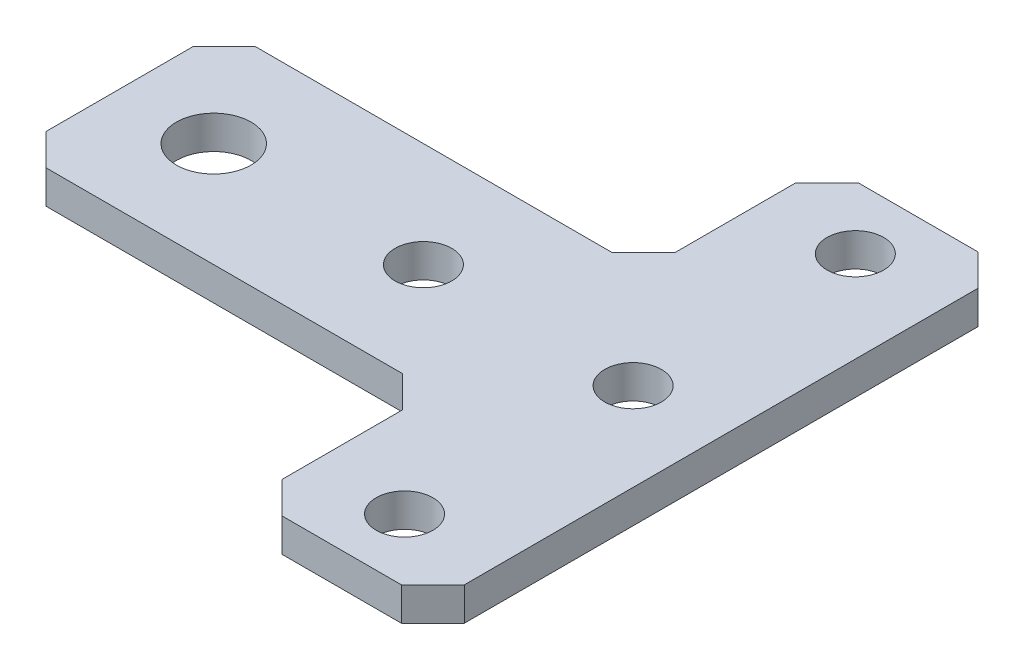
ISO-10303-21;
HEADER;
FILE_DESCRIPTION(('STEP AP214'),'2;1');
FILE_NAME('part.step','',(''),(''),'','','');
FILE_SCHEMA(('AUTOMOTIVE_DESIGN { 1 0 10303 214 1 1 1 1 }'));
ENDSEC;
DATA;
#1=APPLICATION_CONTEXT('core data for automotive mechanical design processes');
#2=APPLICATION_PROTOCOL_DEFINITION('international standard','automotive_design',2000,#1);
#3=PRODUCT_CONTEXT('',#1,'mechanical');
#4=PRODUCT('Part','Part','',(#3));
#5=PRODUCT_RELATED_PRODUCT_CATEGORY('part','',(#4));
#6=PRODUCT_DEFINITION_FORMATION('','',#4);
#7=PRODUCT_DEFINITION_CONTEXT('part definition',#1,'design');
#8=PRODUCT_DEFINITION('design','',#6,#7);
#9=PRODUCT_DEFINITION_SHAPE('','',#8);
#10=(LENGTH_UNIT() NAMED_UNIT(*) SI_UNIT(.MILLI.,.METRE.));
#11=(NAMED_UNIT(*) PLANE_ANGLE_UNIT() SI_UNIT($,.RADIAN.));
#12=(NAMED_UNIT(*) SI_UNIT($,.STERADIAN.) SOLID_ANGLE_UNIT());
#13=UNCERTAINTY_MEASURE_WITH_UNIT(LENGTH_MEASURE(1.E-05),#10,'distance_accuracy_value','');
#14=(GEOMETRIC_REPRESENTATION_CONTEXT(3) GLOBAL_UNCERTAINTY_ASSIGNED_CONTEXT((#13)) GLOBAL_UNIT_ASSIGNED_CONTEXT((#10,
#11,#12)) REPRESENTATION_CONTEXT('',''));
#15=CARTESIAN_POINT('',(0.,0.,0.));
#16=DIRECTION('',(0.,0.,1.));
#17=DIRECTION('',(1.,0.,0.));
#18=AXIS2_PLACEMENT_3D('',#15,#16,#17);
#19=CARTESIAN_POINT('',(0.,3.175,0.));
#20=DIRECTION('',(0.,-1.,0.));
#21=DIRECTION('',(0.,0.,-1.));
#22=AXIS2_PLACEMENT_3D('',#19,#20,#21);
#23=PLANE('',#22);
#24=DIRECTION('',(0.,0.,1.));
#25=VECTOR('',#24,1.);
#26=CARTESIAN_POINT('',(40.,3.175,-20.));
#27=LINE('',#26,#25);
#28=CARTESIAN_POINT('',(40.,3.175,-34.5));
#29=VERTEX_POINT('',#28);
#30=CARTESIAN_POINT('',(40.,3.175,-23.));
#31=VERTEX_POINT('',#30);
#32=EDGE_CURVE('E265',#29,#31,#27,.T.);
#33=ORIENTED_EDGE('',*,*,#32,.T.);
#34=DIRECTION('',(0.707106781186551,0.,-0.707106781186544));
#35=VECTOR('',#34,1.);
#36=CARTESIAN_POINT('',(8.49999999999982,3.175,8.4999999999999));
#37=LINE('',#36,#35);
#38=CARTESIAN_POINT('',(37.,3.175,-20.));
#39=VERTEX_POINT('',#38);
#40=EDGE_CURVE('E258',#31,#39,#37,.F.);
#41=ORIENTED_EDGE('',*,*,#40,.T.);
#42=DIRECTION('',(-1.,0.,0.));
#43=VECTOR('',#42,1.);
#44=CARTESIAN_POINT('',(0.,3.175,-20.));
#45=LINE('',#44,#43);
#46=CARTESIAN_POINT('',(3.00000000000002,3.175,-20.));
#47=VERTEX_POINT('',#46);
#48=EDGE_CURVE('E182',#39,#47,#45,.T.);
#49=ORIENTED_EDGE('',*,*,#48,.T.);
#50=DIRECTION('',(0.707106781186549,0.,-0.707106781186546));
#51=VECTOR('',#50,1.);
#52=CARTESIAN_POINT('',(0.,3.175,-17.));
#53=LINE('',#52,#51);
#54=CARTESIAN_POINT('',(0.,3.175,-17.));
#55=VERTEX_POINT('',#54);
#56=EDGE_CURVE('E221',#47,#55,#53,.F.);
#57=ORIENTED_EDGE('',*,*,#56,.T.);
#58=DIRECTION('',(0.,0.,1.));
#59=VECTOR('',#58,1.);
#60=CARTESIAN_POINT('',(0.,3.175,0.));
#61=LINE('',#60,#59);
#62=CARTESIAN_POINT('',(0.,3.175,-3.00000000000002));
#63=VERTEX_POINT('',#62);
#64=EDGE_CURVE('E167',#55,#63,#61,.T.);
#65=ORIENTED_EDGE('',*,*,#64,.T.);
#66=DIRECTION('',(-0.707106781186546,0.,-0.707106781186549));
#67=VECTOR('',#66,1.);
#68=CARTESIAN_POINT('',(3.00000000000001,3.175,0.));
#69=LINE('',#68,#67);
#70=CARTESIAN_POINT('',(3.00000000000001,3.175,0.));
#71=VERTEX_POINT('',#70);
#72=EDGE_CURVE('E219',#63,#71,#69,.F.);
#73=ORIENTED_EDGE('',*,*,#72,.T.);
#74=DIRECTION('',(1.,0.,0.));
#75=VECTOR('',#74,1.);
#76=CARTESIAN_POINT('',(0.,3.175,0.));
#77=LINE('',#76,#75);
#78=CARTESIAN_POINT('',(37.,3.175,0.));
#79=VERTEX_POINT('',#78);
#80=EDGE_CURVE('E320',#71,#79,#77,.T.);
#81=ORIENTED_EDGE('',*,*,#80,.T.);
#82=DIRECTION('',(-0.707106781186543,0.,-0.707106781186552));
#83=VECTOR('',#82,1.);
#84=CARTESIAN_POINT('',(18.5000000000002,3.175,-18.5));
#85=LINE('',#84,#83);
#86=CARTESIAN_POINT('',(40.,3.175,3.00000000000002));
#87=VERTEX_POINT('',#86);
#88=EDGE_CURVE('E11',#79,#87,#85,.F.);
#89=ORIENTED_EDGE('',*,*,#88,.T.);
#90=DIRECTION('',(0.,0.,1.));
#91=VECTOR('',#90,1.);
#92=CARTESIAN_POINT('',(40.,3.175,17.5));
#93=LINE('',#92,#91);
#94=CARTESIAN_POINT('',(40.,3.175,14.5));
#95=VERTEX_POINT('',#94);
#96=EDGE_CURVE('E317',#87,#95,#93,.T.);
#97=ORIENTED_EDGE('',*,*,#96,.T.);
#98=DIRECTION('',(-0.707106781186544,0.,-0.707106781186551));
#99=VECTOR('',#98,1.);
#100=CARTESIAN_POINT('',(43.,3.175,17.5));
#101=LINE('',#100,#99);
#102=CARTESIAN_POINT('',(43.,3.175,17.5));
#103=VERTEX_POINT('',#102);
#104=EDGE_CURVE('E215',#95,#103,#101,.F.);
#105=ORIENTED_EDGE('',*,*,#104,.T.);
#106=DIRECTION('',(1.,0.,0.));
#107=VECTOR('',#106,1.);
#108=CARTESIAN_POINT('',(40.,3.175,17.5));
#109=LINE('',#108,#107);
#110=CARTESIAN_POINT('',(54.4,3.175,17.5));
#111=VERTEX_POINT('',#110);
#112=EDGE_CURVE('E308',#103,#111,#109,.T.);
#113=ORIENTED_EDGE('',*,*,#112,.T.);
#114=DIRECTION('',(-0.707106781186548,0.,0.707106781186547));
#115=VECTOR('',#114,1.);
#116=CARTESIAN_POINT('',(57.4,3.175,14.5));
#117=LINE('',#116,#115);
#118=CARTESIAN_POINT('',(57.4,3.175,14.5));
#119=VERTEX_POINT('',#118);
#120=EDGE_CURVE('E217',#111,#119,#117,.F.);
#121=ORIENTED_EDGE('',*,*,#120,.T.);
#122=DIRECTION('',(0.,0.,-1.));
#123=VECTOR('',#122,1.);
#124=CARTESIAN_POINT('',(57.4,3.175,17.5));
#125=LINE('',#124,#123);
#126=CARTESIAN_POINT('',(57.4,3.175,-34.5));
#127=VERTEX_POINT('',#126);
#128=EDGE_CURVE('E297',#119,#127,#125,.T.);
#129=ORIENTED_EDGE('',*,*,#128,.T.);
#130=DIRECTION('',(0.707106781186548,0.,0.707106781186548));
#131=VECTOR('',#130,1.);
#132=CARTESIAN_POINT('',(54.4,3.175,-37.5));
#133=LINE('',#132,#131);
#134=CARTESIAN_POINT('',(54.4,3.175,-37.5));
#135=VERTEX_POINT('',#134);
#136=EDGE_CURVE('E213',#127,#135,#133,.F.);
#137=ORIENTED_EDGE('',*,*,#136,.T.);
#138=DIRECTION('',(-1.,0.,0.));
#139=VECTOR('',#138,1.);
#140=CARTESIAN_POINT('',(40.,3.175,-37.5));
#141=LINE('',#140,#139);
#142=CARTESIAN_POINT('',(43.,3.175,-37.5));
#143=VERTEX_POINT('',#142);
#144=EDGE_CURVE('E286',#135,#143,#141,.T.);
#145=ORIENTED_EDGE('',*,*,#144,.T.);
#146=DIRECTION('',(0.707106781186551,0.,-0.707106781186544));
#147=VECTOR('',#146,1.);
#148=CARTESIAN_POINT('',(40.,3.175,-34.5));
#149=LINE('',#148,#147);
#150=EDGE_CURVE('E211',#143,#29,#149,.F.);
#151=ORIENTED_EDGE('',*,*,#150,.T.);
#152=EDGE_LOOP('',(#33,#41,#49,#57,#65,#73,#81,#89,#97,#105,#113,#121,#129,#137,#145,#151));
#153=FACE_BOUND('',#152,.T.);
#154=CARTESIAN_POINT('',(29.,3.175,-10.));
#155=DIRECTION('',(0.,1.,0.));
#156=DIRECTION('',(0.,0.,1.));
#157=AXIS2_PLACEMENT_3D('',#154,#155,#156);
#158=CIRCLE('',#157,2.7);
#159=CARTESIAN_POINT('',(29.,3.175,-7.3));
#160=VERTEX_POINT('',#159);
#161=EDGE_CURVE('E174',#160,#160,#158,.T.);
#162=ORIENTED_EDGE('',*,*,#161,.F.);
#163=EDGE_LOOP('',(#162));
#164=FACE_BOUND('',#163,.T.);
#165=CARTESIAN_POINT('',(9.,3.175,-10.));
#166=DIRECTION('',(0.,1.,0.));
#167=DIRECTION('',(0.,0.,1.));
#168=AXIS2_PLACEMENT_3D('',#165,#166,#167);
#169=CIRCLE('',#168,3.56);
#170=CARTESIAN_POINT('',(9.,3.175,-6.44));
#171=VERTEX_POINT('',#170);
#172=EDGE_CURVE('E331',#171,#171,#169,.T.);
#173=ORIENTED_EDGE('',*,*,#172,.F.);
#174=EDGE_LOOP('',(#173));
#175=FACE_BOUND('',#174,.T.);
#176=CARTESIAN_POINT('',(48.7,3.175,-31.5));
#177=DIRECTION('',(0.,1.,0.));
#178=DIRECTION('',(0.,0.,1.));
#179=AXIS2_PLACEMENT_3D('',#176,#177,#178);
#180=CIRCLE('',#179,2.70000000000001);
#181=CARTESIAN_POINT('',(48.7,3.175,-28.8));
#182=VERTEX_POINT('',#181);
#183=EDGE_CURVE('E336',#182,#182,#180,.T.);
#184=ORIENTED_EDGE('',*,*,#183,.F.);
#185=EDGE_LOOP('',(#184));
#186=FACE_BOUND('',#185,.T.);
#187=CARTESIAN_POINT('',(48.7,3.175,11.5));
#188=DIRECTION('',(0.,1.,0.));
#189=DIRECTION('',(0.,0.,1.));
#190=AXIS2_PLACEMENT_3D('',#187,#188,#189);
#191=CIRCLE('',#190,2.70000000000001);
#192=CARTESIAN_POINT('',(48.7,3.175,14.2));
#193=VERTEX_POINT('',#192);
#194=EDGE_CURVE('E342',#193,#193,#191,.T.);
#195=ORIENTED_EDGE('',*,*,#194,.F.);
#196=EDGE_LOOP('',(#195));
#197=FACE_BOUND('',#196,.T.);
#198=CARTESIAN_POINT('',(49.,3.175,-10.));
#199=DIRECTION('',(0.,1.,0.));
#200=DIRECTION('',(0.,0.,1.));
#201=AXIS2_PLACEMENT_3D('',#198,#199,#200);
#202=CIRCLE('',#201,2.7);
#203=CARTESIAN_POINT('',(49.,3.175,-7.30000000000001));
#204=VERTEX_POINT('',#203);
#205=EDGE_CURVE('E348',#204,#204,#202,.T.);
#206=ORIENTED_EDGE('',*,*,#205,.F.);
#207=EDGE_LOOP('',(#206));
#208=FACE_BOUND('',#207,.T.);
#209=ADVANCED_FACE('F35',(#153,#164,#175,#186,#197,#208),#23,.F.);
#210=CARTESIAN_POINT('',(0.,0.,0.));
#211=DIRECTION('',(0.,-1.,0.));
#212=DIRECTION('',(0.,0.,-1.));
#213=AXIS2_PLACEMENT_3D('',#210,#211,#212);
#214=PLANE('',#213);
#215=CARTESIAN_POINT('',(48.7,0.,11.5));
#216=DIRECTION('',(0.,1.,0.));
#217=DIRECTION('',(0.,0.,1.));
#218=AXIS2_PLACEMENT_3D('',#215,#216,#217);
#219=CIRCLE('',#218,2.70000000000001);
#220=CARTESIAN_POINT('',(48.7,0.,14.2));
#221=VERTEX_POINT('',#220);
#222=EDGE_CURVE('E345',#221,#221,#219,.T.);
#223=ORIENTED_EDGE('',*,*,#222,.T.);
#224=EDGE_LOOP('',(#223));
#225=FACE_BOUND('',#224,.T.);
#226=CARTESIAN_POINT('',(9.,0.,-10.));
#227=DIRECTION('',(0.,1.,0.));
#228=DIRECTION('',(0.,0.,1.));
#229=AXIS2_PLACEMENT_3D('',#226,#227,#228);
#230=CIRCLE('',#229,3.56);
#231=CARTESIAN_POINT('',(9.,0.,-6.44));
#232=VERTEX_POINT('',#231);
#233=EDGE_CURVE('E333',#232,#232,#230,.T.);
#234=ORIENTED_EDGE('',*,*,#233,.T.);
#235=EDGE_LOOP('',(#234));
#236=FACE_BOUND('',#235,.T.);
#237=DIRECTION('',(0.,0.,1.));
#238=VECTOR('',#237,1.);
#239=CARTESIAN_POINT('',(0.,0.,0.));
#240=LINE('',#239,#238);
#241=CARTESIAN_POINT('',(0.,0.,-17.));
#242=VERTEX_POINT('',#241);
#243=CARTESIAN_POINT('',(0.,0.,-3.00000000000002));
#244=VERTEX_POINT('',#243);
#245=EDGE_CURVE('E164',#242,#244,#240,.T.);
#246=ORIENTED_EDGE('',*,*,#245,.F.);
#247=DIRECTION('',(-0.707106781186549,0.,0.707106781186546));
#248=VECTOR('',#247,1.);
#249=CARTESIAN_POINT('',(-8.49999999999999,0.,-8.50000000000004));
#250=LINE('',#249,#248);
#251=CARTESIAN_POINT('',(3.00000000000002,0.,-20.));
#252=VERTEX_POINT('',#251);
#253=EDGE_CURVE('E149',#242,#252,#250,.F.);
#254=ORIENTED_EDGE('',*,*,#253,.T.);
#255=DIRECTION('',(-1.,0.,0.));
#256=VECTOR('',#255,1.);
#257=CARTESIAN_POINT('',(0.,0.,-20.));
#258=LINE('',#257,#256);
#259=CARTESIAN_POINT('',(37.,0.,-20.));
#260=VERTEX_POINT('',#259);
#261=EDGE_CURVE('E198',#260,#252,#258,.T.);
#262=ORIENTED_EDGE('',*,*,#261,.F.);
#263=DIRECTION('',(-0.707106781186551,0.,0.707106781186544));
#264=VECTOR('',#263,1.);
#265=CARTESIAN_POINT('',(37.,0.,-20.));
#266=LINE('',#265,#264);
#267=CARTESIAN_POINT('',(40.,0.,-23.));
#268=VERTEX_POINT('',#267);
#269=EDGE_CURVE('E256',#260,#268,#266,.F.);
#270=ORIENTED_EDGE('',*,*,#269,.T.);
#271=DIRECTION('',(0.,0.,1.));
#272=VECTOR('',#271,1.);
#273=CARTESIAN_POINT('',(40.,0.,-20.));
#274=LINE('',#273,#272);
#275=CARTESIAN_POINT('',(40.,0.,-34.5));
#276=VERTEX_POINT('',#275);
#277=EDGE_CURVE('E195',#276,#268,#274,.T.);
#278=ORIENTED_EDGE('',*,*,#277,.F.);
#279=DIRECTION('',(-0.707106781186551,0.,0.707106781186544));
#280=VECTOR('',#279,1.);
#281=CARTESIAN_POINT('',(2.74999999999981,0.,2.74999999999983));
#282=LINE('',#281,#280);
#283=CARTESIAN_POINT('',(43.,0.,-37.5));
#284=VERTEX_POINT('',#283);
#285=EDGE_CURVE('E168',#276,#284,#282,.F.);
#286=ORIENTED_EDGE('',*,*,#285,.T.);
#287=DIRECTION('',(-1.,0.,0.));
#288=VECTOR('',#287,1.);
#289=CARTESIAN_POINT('',(40.,0.,-37.5));
#290=LINE('',#289,#288);
#291=CARTESIAN_POINT('',(54.4,0.,-37.5));
#292=VERTEX_POINT('',#291);
#293=EDGE_CURVE('E192',#292,#284,#290,.T.);
#294=ORIENTED_EDGE('',*,*,#293,.F.);
#295=DIRECTION('',(-0.707106781186548,0.,-0.707106781186548));
#296=VECTOR('',#295,1.);
#297=CARTESIAN_POINT('',(45.95,0.,-45.95));
#298=LINE('',#297,#296);
#299=CARTESIAN_POINT('',(57.4,0.,-34.5));
#300=VERTEX_POINT('',#299);
#301=EDGE_CURVE('E202',#292,#300,#298,.F.);
#302=ORIENTED_EDGE('',*,*,#301,.T.);
#303=DIRECTION('',(0.,0.,-1.));
#304=VECTOR('',#303,1.);
#305=CARTESIAN_POINT('',(57.4,0.,17.5));
#306=LINE('',#305,#304);
#307=CARTESIAN_POINT('',(57.4,0.,14.5));
#308=VERTEX_POINT('',#307);
#309=EDGE_CURVE('E189',#308,#300,#306,.T.);
#310=ORIENTED_EDGE('',*,*,#309,.F.);
#311=DIRECTION('',(0.707106781186548,0.,-0.707106781186547));
#312=VECTOR('',#311,1.);
#313=CARTESIAN_POINT('',(35.9499999999999,0.,35.95));
#314=LINE('',#313,#312);
#315=CARTESIAN_POINT('',(54.4,0.,17.5));
#316=VERTEX_POINT('',#315);
#317=EDGE_CURVE('E207',#308,#316,#314,.F.);
#318=ORIENTED_EDGE('',*,*,#317,.T.);
#319=DIRECTION('',(1.,0.,0.));
#320=VECTOR('',#319,1.);
#321=CARTESIAN_POINT('',(40.,0.,17.5));
#322=LINE('',#321,#320);
#323=CARTESIAN_POINT('',(43.,0.,17.5));
#324=VERTEX_POINT('',#323);
#325=EDGE_CURVE('E186',#324,#316,#322,.T.);
#326=ORIENTED_EDGE('',*,*,#325,.F.);
#327=DIRECTION('',(0.707106781186544,0.,0.707106781186551));
#328=VECTOR('',#327,1.);
#329=CARTESIAN_POINT('',(12.7500000000002,0.,-12.7500000000001));
#330=LINE('',#329,#328);
#331=CARTESIAN_POINT('',(40.,0.,14.5));
#332=VERTEX_POINT('',#331);
#333=EDGE_CURVE('E204',#324,#332,#330,.F.);
#334=ORIENTED_EDGE('',*,*,#333,.T.);
#335=DIRECTION('',(0.,0.,1.));
#336=VECTOR('',#335,1.);
#337=CARTESIAN_POINT('',(40.,0.,17.5));
#338=LINE('',#337,#336);
#339=CARTESIAN_POINT('',(40.,0.,3.00000000000002));
#340=VERTEX_POINT('',#339);
#341=EDGE_CURVE('E176',#340,#332,#338,.T.);
#342=ORIENTED_EDGE('',*,*,#341,.F.);
#343=DIRECTION('',(0.707106781186543,0.,0.707106781186552));
#344=VECTOR('',#343,1.);
#345=CARTESIAN_POINT('',(40.,0.,3.00000000000002));
#346=LINE('',#345,#344);
#347=CARTESIAN_POINT('',(37.,0.,0.));
#348=VERTEX_POINT('',#347);
#349=EDGE_CURVE('E43',#340,#348,#346,.F.);
#350=ORIENTED_EDGE('',*,*,#349,.T.);
#351=DIRECTION('',(1.,0.,0.));
#352=VECTOR('',#351,1.);
#353=CARTESIAN_POINT('',(0.,0.,0.));
#354=LINE('',#353,#352);
#355=CARTESIAN_POINT('',(3.00000000000001,0.,0.));
#356=VERTEX_POINT('',#355);
#357=EDGE_CURVE('E173',#356,#348,#354,.T.);
#358=ORIENTED_EDGE('',*,*,#357,.F.);
#359=DIRECTION('',(0.707106781186546,0.,0.707106781186549));
#360=VECTOR('',#359,1.);
#361=CARTESIAN_POINT('',(1.50000000000001,0.,-1.5));
#362=LINE('',#361,#360);
#363=EDGE_CURVE('E158',#356,#244,#362,.F.);
#364=ORIENTED_EDGE('',*,*,#363,.T.);
#365=EDGE_LOOP('',(#246,#254,#262,#270,#278,#286,#294,#302,#310,#318,#326,#334,#342,#350,#358,#364));
#366=FACE_BOUND('',#365,.T.);
#367=CARTESIAN_POINT('',(29.,0.,-10.));
#368=DIRECTION('',(0.,1.,0.));
#369=DIRECTION('',(0.,0.,1.));
#370=AXIS2_PLACEMENT_3D('',#367,#368,#369);
#371=CIRCLE('',#370,2.7);
#372=CARTESIAN_POINT('',(29.,0.,-7.3));
#373=VERTEX_POINT('',#372);
#374=EDGE_CURVE('E179',#373,#373,#371,.T.);
#375=ORIENTED_EDGE('',*,*,#374,.T.);
#376=EDGE_LOOP('',(#375));
#377=FACE_BOUND('',#376,.T.);
#378=CARTESIAN_POINT('',(48.7,0.,-31.5));
#379=DIRECTION('',(0.,1.,0.));
#380=DIRECTION('',(0.,0.,1.));
#381=AXIS2_PLACEMENT_3D('',#378,#379,#380);
#382=CIRCLE('',#381,2.70000000000001);
#383=CARTESIAN_POINT('',(48.7,0.,-28.8));
#384=VERTEX_POINT('',#383);
#385=EDGE_CURVE('E339',#384,#384,#382,.T.);
#386=ORIENTED_EDGE('',*,*,#385,.T.);
#387=EDGE_LOOP('',(#386));
#388=FACE_BOUND('',#387,.T.);
#389=CARTESIAN_POINT('',(49.,0.,-10.));
#390=DIRECTION('',(0.,1.,0.));
#391=DIRECTION('',(0.,0.,1.));
#392=AXIS2_PLACEMENT_3D('',#389,#390,#391);
#393=CIRCLE('',#392,2.7);
#394=CARTESIAN_POINT('',(49.,0.,-7.30000000000001));
#395=VERTEX_POINT('',#394);
#396=EDGE_CURVE('E351',#395,#395,#393,.T.);
#397=ORIENTED_EDGE('',*,*,#396,.T.);
#398=EDGE_LOOP('',(#397));
#399=FACE_BOUND('',#398,.T.);
#400=ADVANCED_FACE('F171',(#225,#236,#366,#377,#388,#399),#214,.T.);
#401=CARTESIAN_POINT('',(0.,3.175,0.));
#402=DIRECTION('',(1.,0.,0.));
#403=DIRECTION('',(0.,0.,-1.));
#404=AXIS2_PLACEMENT_3D('',#401,#402,#403);
#405=PLANE('',#404);
#406=ORIENTED_EDGE('',*,*,#64,.F.);
#407=DIRECTION('',(0.,-1.,0.));
#408=VECTOR('',#407,1.);
#409=CARTESIAN_POINT('',(0.,3.175,-17.));
#410=LINE('',#409,#408);
#411=EDGE_CURVE('E153',#55,#242,#410,.T.);
#412=ORIENTED_EDGE('',*,*,#411,.T.);
#413=ORIENTED_EDGE('',*,*,#245,.T.);
#414=DIRECTION('',(0.,1.,0.));
#415=VECTOR('',#414,1.);
#416=CARTESIAN_POINT('',(0.,3.175,-3.00000000000002));
#417=LINE('',#416,#415);
#418=EDGE_CURVE('E169',#244,#63,#417,.T.);
#419=ORIENTED_EDGE('',*,*,#418,.T.);
#420=EDGE_LOOP('',(#406,#412,#413,#419));
#421=FACE_BOUND('',#420,.T.);
#422=ADVANCED_FACE('F163',(#421),#405,.F.);
#423=CARTESIAN_POINT('',(0.,3.175,0.));
#424=DIRECTION('',(0.,0.,-1.));
#425=DIRECTION('',(-1.,0.,0.));
#426=AXIS2_PLACEMENT_3D('',#423,#424,#425);
#427=PLANE('',#426);
#428=ORIENTED_EDGE('',*,*,#357,.T.);
#429=DIRECTION('',(0.,1.,0.));
#430=VECTOR('',#429,1.);
#431=CARTESIAN_POINT('',(37.,3.175,0.));
#432=LINE('',#431,#430);
#433=EDGE_CURVE('E56',#348,#79,#432,.T.);
#434=ORIENTED_EDGE('',*,*,#433,.T.);
#435=ORIENTED_EDGE('',*,*,#80,.F.);
#436=DIRECTION('',(0.,-1.,0.));
#437=VECTOR('',#436,1.);
#438=CARTESIAN_POINT('',(3.00000000000001,3.175,0.));
#439=LINE('',#438,#437);
#440=EDGE_CURVE('E223',#71,#356,#439,.T.);
#441=ORIENTED_EDGE('',*,*,#440,.T.);
#442=EDGE_LOOP('',(#428,#434,#435,#441));
#443=FACE_BOUND('',#442,.T.);
#444=ADVANCED_FACE('F383',(#443),#427,.F.);
#445=CARTESIAN_POINT('',(40.,3.175,17.5));
#446=DIRECTION('',(1.,0.,0.));
#447=DIRECTION('',(0.,0.,-1.));
#448=AXIS2_PLACEMENT_3D('',#445,#446,#447);
#449=PLANE('',#448);
#450=ORIENTED_EDGE('',*,*,#96,.F.);
#451=DIRECTION('',(0.,-1.,0.));
#452=VECTOR('',#451,1.);
#453=CARTESIAN_POINT('',(40.,0.,3.00000000000002));
#454=LINE('',#453,#452);
#455=EDGE_CURVE('E252',#87,#340,#454,.T.);
#456=ORIENTED_EDGE('',*,*,#455,.T.);
#457=ORIENTED_EDGE('',*,*,#341,.T.);
#458=DIRECTION('',(0.,1.,0.));
#459=VECTOR('',#458,1.);
#460=CARTESIAN_POINT('',(40.,3.175,14.5));
#461=LINE('',#460,#459);
#462=EDGE_CURVE('E236',#332,#95,#461,.T.);
#463=ORIENTED_EDGE('',*,*,#462,.T.);
#464=EDGE_LOOP('',(#450,#456,#457,#463));
#465=FACE_BOUND('',#464,.T.);
#466=ADVANCED_FACE('F315',(#465),#449,.F.);
#467=CARTESIAN_POINT('',(40.,3.175,17.5));
#468=DIRECTION('',(0.,0.,-1.));
#469=DIRECTION('',(-1.,0.,0.));
#470=AXIS2_PLACEMENT_3D('',#467,#468,#469);
#471=PLANE('',#470);
#472=ORIENTED_EDGE('',*,*,#325,.T.);
#473=DIRECTION('',(0.,1.,0.));
#474=VECTOR('',#473,1.);
#475=CARTESIAN_POINT('',(54.4,3.175,17.5));
#476=LINE('',#475,#474);
#477=EDGE_CURVE('E234',#316,#111,#476,.T.);
#478=ORIENTED_EDGE('',*,*,#477,.T.);
#479=ORIENTED_EDGE('',*,*,#112,.F.);
#480=DIRECTION('',(0.,-1.,0.));
#481=VECTOR('',#480,1.);
#482=CARTESIAN_POINT('',(43.,3.175,17.5));
#483=LINE('',#482,#481);
#484=EDGE_CURVE('E231',#103,#324,#483,.T.);
#485=ORIENTED_EDGE('',*,*,#484,.T.);
#486=EDGE_LOOP('',(#472,#478,#479,#485));
#487=FACE_BOUND('',#486,.T.);
#488=ADVANCED_FACE('F304',(#487),#471,.F.);
#489=CARTESIAN_POINT('',(57.4,3.175,17.5));
#490=DIRECTION('',(-1.,0.,0.));
#491=DIRECTION('',(0.,0.,1.));
#492=AXIS2_PLACEMENT_3D('',#489,#490,#491);
#493=PLANE('',#492);
#494=ORIENTED_EDGE('',*,*,#128,.F.);
#495=DIRECTION('',(0.,-1.,0.));
#496=VECTOR('',#495,1.);
#497=CARTESIAN_POINT('',(57.4,3.175,14.5));
#498=LINE('',#497,#496);
#499=EDGE_CURVE('E228',#119,#308,#498,.T.);
#500=ORIENTED_EDGE('',*,*,#499,.T.);
#501=ORIENTED_EDGE('',*,*,#309,.T.);
#502=DIRECTION('',(0.,1.,0.));
#503=VECTOR('',#502,1.);
#504=CARTESIAN_POINT('',(57.4,3.175,-34.5));
#505=LINE('',#504,#503);
#506=EDGE_CURVE('E226',#300,#127,#505,.T.);
#507=ORIENTED_EDGE('',*,*,#506,.T.);
#508=EDGE_LOOP('',(#494,#500,#501,#507));
#509=FACE_BOUND('',#508,.T.);
#510=ADVANCED_FACE('F294',(#509),#493,.F.);
#511=CARTESIAN_POINT('',(40.,3.175,-37.5));
#512=DIRECTION('',(0.,0.,1.));
#513=DIRECTION('',(1.,0.,0.));
#514=AXIS2_PLACEMENT_3D('',#511,#512,#513);
#515=PLANE('',#514);
#516=ORIENTED_EDGE('',*,*,#144,.F.);
#517=DIRECTION('',(0.,-1.,0.));
#518=VECTOR('',#517,1.);
#519=CARTESIAN_POINT('',(54.4,3.175,-37.5));
#520=LINE('',#519,#518);
#521=EDGE_CURVE('E241',#135,#292,#520,.T.);
#522=ORIENTED_EDGE('',*,*,#521,.T.);
#523=ORIENTED_EDGE('',*,*,#293,.T.);
#524=DIRECTION('',(0.,1.,0.));
#525=VECTOR('',#524,1.);
#526=CARTESIAN_POINT('',(43.,3.175,-37.5));
#527=LINE('',#526,#525);
#528=EDGE_CURVE('E239',#284,#143,#527,.T.);
#529=ORIENTED_EDGE('',*,*,#528,.T.);
#530=EDGE_LOOP('',(#516,#522,#523,#529));
#531=FACE_BOUND('',#530,.T.);
#532=ADVANCED_FACE('F283',(#531),#515,.F.);
#533=CARTESIAN_POINT('',(40.,3.175,-20.));
#534=DIRECTION('',(1.,0.,0.));
#535=DIRECTION('',(0.,0.,-1.));
#536=AXIS2_PLACEMENT_3D('',#533,#534,#535);
#537=PLANE('',#536);
#538=ORIENTED_EDGE('',*,*,#277,.T.);
#539=DIRECTION('',(0.,1.,0.));
#540=VECTOR('',#539,1.);
#541=CARTESIAN_POINT('',(40.,3.175,-23.));
#542=LINE('',#541,#540);
#543=EDGE_CURVE('E250',#268,#31,#542,.T.);
#544=ORIENTED_EDGE('',*,*,#543,.T.);
#545=ORIENTED_EDGE('',*,*,#32,.F.);
#546=DIRECTION('',(0.,-1.,0.));
#547=VECTOR('',#546,1.);
#548=CARTESIAN_POINT('',(40.,3.175,-34.5));
#549=LINE('',#548,#547);
#550=EDGE_CURVE('E244',#29,#276,#549,.T.);
#551=ORIENTED_EDGE('',*,*,#550,.T.);
#552=EDGE_LOOP('',(#538,#544,#545,#551));
#553=FACE_BOUND('',#552,.T.);
#554=ADVANCED_FACE('F274',(#553),#537,.F.);
#555=CARTESIAN_POINT('',(0.,3.175,-20.));
#556=DIRECTION('',(0.,0.,1.));
#557=DIRECTION('',(1.,0.,0.));
#558=AXIS2_PLACEMENT_3D('',#555,#556,#557);
#559=PLANE('',#558);
#560=ORIENTED_EDGE('',*,*,#48,.F.);
#561=DIRECTION('',(0.,-1.,0.));
#562=VECTOR('',#561,1.);
#563=CARTESIAN_POINT('',(37.,0.,-20.));
#564=LINE('',#563,#562);
#565=EDGE_CURVE('E247',#39,#260,#564,.T.);
#566=ORIENTED_EDGE('',*,*,#565,.T.);
#567=ORIENTED_EDGE('',*,*,#261,.T.);
#568=DIRECTION('',(0.,1.,0.));
#569=VECTOR('',#568,1.);
#570=CARTESIAN_POINT('',(3.00000000000002,3.175,-20.));
#571=LINE('',#570,#569);
#572=EDGE_CURVE('E155',#252,#47,#571,.T.);
#573=ORIENTED_EDGE('',*,*,#572,.T.);
#574=EDGE_LOOP('',(#560,#566,#567,#573));
#575=FACE_BOUND('',#574,.T.);
#576=ADVANCED_FACE('F270',(#575),#559,.F.);
#577=CARTESIAN_POINT('',(29.,3.175,-10.));
#578=DIRECTION('',(0.,-1.,0.));
#579=DIRECTION('',(0.,0.,-1.));
#580=AXIS2_PLACEMENT_3D('',#577,#578,#579);
#581=CYLINDRICAL_SURFACE('',#580,2.7);
#582=ORIENTED_EDGE('',*,*,#161,.T.);
#583=EDGE_LOOP('',(#582));
#584=FACE_BOUND('',#583,.T.);
#585=ORIENTED_EDGE('',*,*,#374,.F.);
#586=EDGE_LOOP('',(#585));
#587=FACE_BOUND('',#586,.T.);
#588=ADVANCED_FACE('F368',(#584,#587),#581,.F.);
#589=CARTESIAN_POINT('',(9.,3.175,-10.));
#590=DIRECTION('',(0.,-1.,0.));
#591=DIRECTION('',(0.,0.,-1.));
#592=AXIS2_PLACEMENT_3D('',#589,#590,#591);
#593=CYLINDRICAL_SURFACE('',#592,3.56);
#594=ORIENTED_EDGE('',*,*,#172,.T.);
#595=EDGE_LOOP('',(#594));
#596=FACE_BOUND('',#595,.T.);
#597=ORIENTED_EDGE('',*,*,#233,.F.);
#598=EDGE_LOOP('',(#597));
#599=FACE_BOUND('',#598,.T.);
#600=ADVANCED_FACE('F535',(#596,#599),#593,.F.);
#601=CARTESIAN_POINT('',(48.7,3.175,-31.5));
#602=DIRECTION('',(0.,-1.,0.));
#603=DIRECTION('',(0.,0.,-1.));
#604=AXIS2_PLACEMENT_3D('',#601,#602,#603);
#605=CYLINDRICAL_SURFACE('',#604,2.70000000000001);
#606=ORIENTED_EDGE('',*,*,#183,.T.);
#607=EDGE_LOOP('',(#606));
#608=FACE_BOUND('',#607,.T.);
#609=ORIENTED_EDGE('',*,*,#385,.F.);
#610=EDGE_LOOP('',(#609));
#611=FACE_BOUND('',#610,.T.);
#612=ADVANCED_FACE('F525',(#608,#611),#605,.F.);
#613=CARTESIAN_POINT('',(48.7,3.175,11.5));
#614=DIRECTION('',(0.,-1.,0.));
#615=DIRECTION('',(0.,0.,-1.));
#616=AXIS2_PLACEMENT_3D('',#613,#614,#615);
#617=CYLINDRICAL_SURFACE('',#616,2.70000000000001);
#618=ORIENTED_EDGE('',*,*,#194,.T.);
#619=EDGE_LOOP('',(#618));
#620=FACE_BOUND('',#619,.T.);
#621=ORIENTED_EDGE('',*,*,#222,.F.);
#622=EDGE_LOOP('',(#621));
#623=FACE_BOUND('',#622,.T.);
#624=ADVANCED_FACE('F516',(#620,#623),#617,.F.);
#625=CARTESIAN_POINT('',(49.,3.175,-10.));
#626=DIRECTION('',(0.,-1.,0.));
#627=DIRECTION('',(0.,0.,-1.));
#628=AXIS2_PLACEMENT_3D('',#625,#626,#627);
#629=CYLINDRICAL_SURFACE('',#628,2.7);
#630=ORIENTED_EDGE('',*,*,#205,.T.);
#631=EDGE_LOOP('',(#630));
#632=FACE_BOUND('',#631,.T.);
#633=ORIENTED_EDGE('',*,*,#396,.F.);
#634=EDGE_LOOP('',(#633));
#635=FACE_BOUND('',#634,.T.);
#636=ADVANCED_FACE('F357',(#632,#635),#629,.F.);
#637=CARTESIAN_POINT('',(0.,3.175,-17.));
#638=DIRECTION('',(0.707106781186546,0.,0.707106781186549));
#639=DIRECTION('',(0.,-1.,0.));
#640=AXIS2_PLACEMENT_3D('',#637,#638,#639);
#641=PLANE('',#640);
#642=ORIENTED_EDGE('',*,*,#56,.F.);
#643=ORIENTED_EDGE('',*,*,#572,.F.);
#644=ORIENTED_EDGE('',*,*,#253,.F.);
#645=ORIENTED_EDGE('',*,*,#411,.F.);
#646=EDGE_LOOP('',(#642,#643,#644,#645));
#647=FACE_BOUND('',#646,.T.);
#648=ADVANCED_FACE('F152',(#647),#641,.F.);
#649=CARTESIAN_POINT('',(3.00000000000001,3.175,0.));
#650=DIRECTION('',(0.707106781186549,0.,-0.707106781186546));
#651=DIRECTION('',(0.,-1.,0.));
#652=AXIS2_PLACEMENT_3D('',#649,#650,#651);
#653=PLANE('',#652);
#654=ORIENTED_EDGE('',*,*,#72,.F.);
#655=ORIENTED_EDGE('',*,*,#418,.F.);
#656=ORIENTED_EDGE('',*,*,#363,.F.);
#657=ORIENTED_EDGE('',*,*,#440,.F.);
#658=EDGE_LOOP('',(#654,#655,#656,#657));
#659=FACE_BOUND('',#658,.T.);
#660=ADVANCED_FACE('F390',(#659),#653,.F.);
#661=CARTESIAN_POINT('',(57.4,3.175,14.5));
#662=DIRECTION('',(-0.707106781186547,0.,-0.707106781186548));
#663=DIRECTION('',(0.,-1.,0.));
#664=AXIS2_PLACEMENT_3D('',#661,#662,#663);
#665=PLANE('',#664);
#666=ORIENTED_EDGE('',*,*,#120,.F.);
#667=ORIENTED_EDGE('',*,*,#477,.F.);
#668=ORIENTED_EDGE('',*,*,#317,.F.);
#669=ORIENTED_EDGE('',*,*,#499,.F.);
#670=EDGE_LOOP('',(#666,#667,#668,#669));
#671=FACE_BOUND('',#670,.T.);
#672=ADVANCED_FACE('F300',(#671),#665,.F.);
#673=CARTESIAN_POINT('',(43.,3.175,17.5));
#674=DIRECTION('',(0.707106781186551,0.,-0.707106781186544));
#675=DIRECTION('',(0.,-1.,0.));
#676=AXIS2_PLACEMENT_3D('',#673,#674,#675);
#677=PLANE('',#676);
#678=ORIENTED_EDGE('',*,*,#104,.F.);
#679=ORIENTED_EDGE('',*,*,#462,.F.);
#680=ORIENTED_EDGE('',*,*,#333,.F.);
#681=ORIENTED_EDGE('',*,*,#484,.F.);
#682=EDGE_LOOP('',(#678,#679,#680,#681));
#683=FACE_BOUND('',#682,.T.);
#684=ADVANCED_FACE('F311',(#683),#677,.F.);
#685=CARTESIAN_POINT('',(54.4,3.175,-37.5));
#686=DIRECTION('',(-0.707106781186547,0.,0.707106781186547));
#687=DIRECTION('',(0.,-1.,0.));
#688=AXIS2_PLACEMENT_3D('',#685,#686,#687);
#689=PLANE('',#688);
#690=ORIENTED_EDGE('',*,*,#136,.F.);
#691=ORIENTED_EDGE('',*,*,#506,.F.);
#692=ORIENTED_EDGE('',*,*,#301,.F.);
#693=ORIENTED_EDGE('',*,*,#521,.F.);
#694=EDGE_LOOP('',(#690,#691,#692,#693));
#695=FACE_BOUND('',#694,.T.);
#696=ADVANCED_FACE('F289',(#695),#689,.F.);
#697=CARTESIAN_POINT('',(40.,3.175,-34.5));
#698=DIRECTION('',(0.707106781186544,0.,0.707106781186551));
#699=DIRECTION('',(0.,-1.,0.));
#700=AXIS2_PLACEMENT_3D('',#697,#698,#699);
#701=PLANE('',#700);
#702=ORIENTED_EDGE('',*,*,#150,.F.);
#703=ORIENTED_EDGE('',*,*,#528,.F.);
#704=ORIENTED_EDGE('',*,*,#285,.F.);
#705=ORIENTED_EDGE('',*,*,#550,.F.);
#706=EDGE_LOOP('',(#702,#703,#704,#705));
#707=FACE_BOUND('',#706,.T.);
#708=ADVANCED_FACE('F278',(#707),#701,.F.);
#709=CARTESIAN_POINT('',(37.,3.175,-20.));
#710=DIRECTION('',(-0.707106781186544,0.,-0.707106781186551));
#711=DIRECTION('',(0.,1.,0.));
#712=AXIS2_PLACEMENT_3D('',#709,#710,#711);
#713=PLANE('',#712);
#714=ORIENTED_EDGE('',*,*,#40,.F.);
#715=ORIENTED_EDGE('',*,*,#543,.F.);
#716=ORIENTED_EDGE('',*,*,#269,.F.);
#717=ORIENTED_EDGE('',*,*,#565,.F.);
#718=EDGE_LOOP('',(#714,#715,#716,#717));
#719=FACE_BOUND('',#718,.T.);
#720=ADVANCED_FACE('F271',(#719),#713,.T.);
#721=CARTESIAN_POINT('',(40.,3.175,3.00000000000002));
#722=DIRECTION('',(-0.707106781186552,0.,0.707106781186543));
#723=DIRECTION('',(0.,1.,0.));
#724=AXIS2_PLACEMENT_3D('',#721,#722,#723);
#725=PLANE('',#724);
#726=ORIENTED_EDGE('',*,*,#88,.F.);
#727=ORIENTED_EDGE('',*,*,#433,.F.);
#728=ORIENTED_EDGE('',*,*,#349,.F.);
#729=ORIENTED_EDGE('',*,*,#455,.F.);
#730=EDGE_LOOP('',(#726,#727,#728,#729));
#731=FACE_BOUND('',#730,.T.);
#732=ADVANCED_FACE('F37',(#731),#725,.T.);
#733=CLOSED_SHELL('',(#209,#400,#422,#444,#466,#488,#510,#532,#554,#576,#588,#600,#612,#624,
#636,#648,#660,#672,#684,#696,#708,#720,#732));
#734=MANIFOLD_SOLID_BREP('B2',#733);
#735=ADVANCED_BREP_SHAPE_REPRESENTATION('',(#18,#734),#14);
#736=SHAPE_DEFINITION_REPRESENTATION(#9,#735);
ENDSEC;
END-ISO-10303-21;
